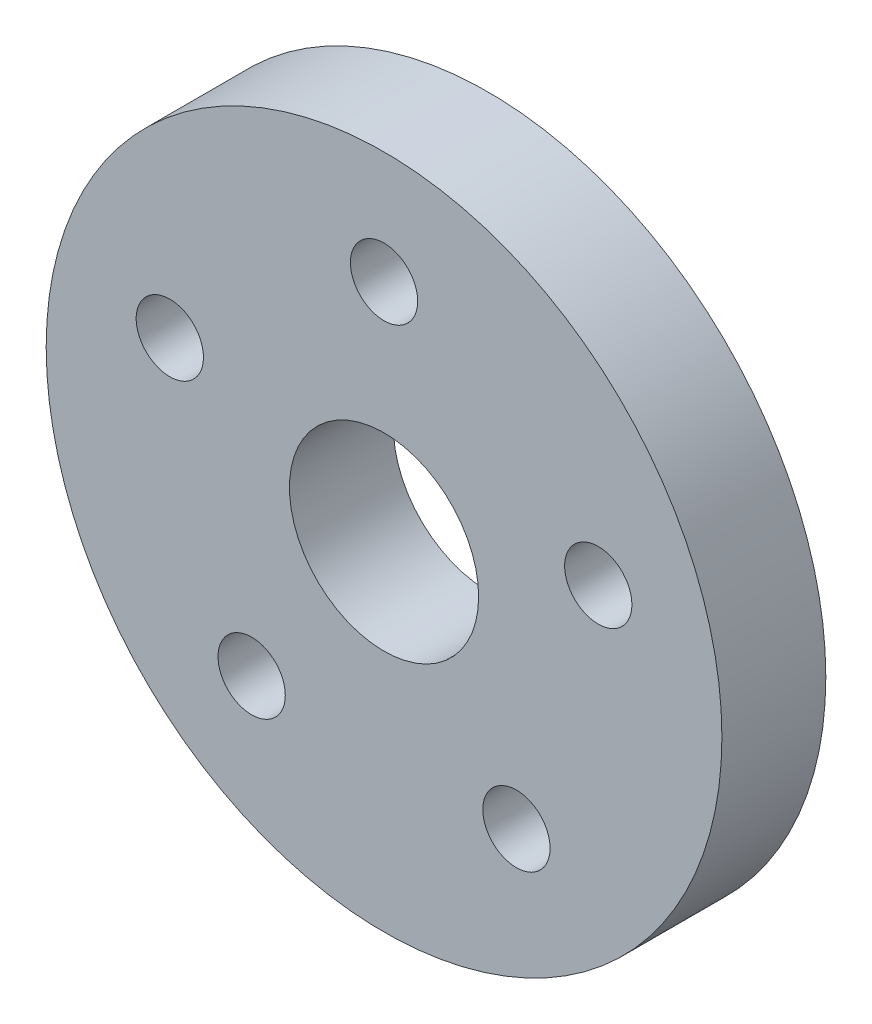
ISO-10303-21;
HEADER;
FILE_DESCRIPTION(('STEP AP214'),'2;1');
FILE_NAME('part.step','',(''),(''),'','','');
FILE_SCHEMA(('AUTOMOTIVE_DESIGN { 1 0 10303 214 1 1 1 1 }'));
ENDSEC;
DATA;
#1=APPLICATION_CONTEXT('core data for automotive mechanical design processes');
#2=APPLICATION_PROTOCOL_DEFINITION('international standard','automotive_design',2000,#1);
#3=PRODUCT_CONTEXT('',#1,'mechanical');
#4=PRODUCT('Part','Part','',(#3));
#5=PRODUCT_RELATED_PRODUCT_CATEGORY('part','',(#4));
#6=PRODUCT_DEFINITION_FORMATION('','',#4);
#7=PRODUCT_DEFINITION_CONTEXT('part definition',#1,'design');
#8=PRODUCT_DEFINITION('design','',#6,#7);
#9=PRODUCT_DEFINITION_SHAPE('','',#8);
#10=(LENGTH_UNIT() NAMED_UNIT(*) SI_UNIT(.MILLI.,.METRE.));
#11=(NAMED_UNIT(*) PLANE_ANGLE_UNIT() SI_UNIT($,.RADIAN.));
#12=(NAMED_UNIT(*) SI_UNIT($,.STERADIAN.) SOLID_ANGLE_UNIT());
#13=UNCERTAINTY_MEASURE_WITH_UNIT(LENGTH_MEASURE(1.E-05),#10,'distance_accuracy_value','');
#14=(GEOMETRIC_REPRESENTATION_CONTEXT(3) GLOBAL_UNCERTAINTY_ASSIGNED_CONTEXT((#13)) GLOBAL_UNIT_ASSIGNED_CONTEXT((#10,
#11,#12)) REPRESENTATION_CONTEXT('',''));
#15=CARTESIAN_POINT('',(0.,0.,0.));
#16=DIRECTION('',(0.,0.,1.));
#17=DIRECTION('',(1.,0.,0.));
#18=AXIS2_PLACEMENT_3D('',#15,#16,#17);
#19=CARTESIAN_POINT('',(0.,0.,4.3942));
#20=DIRECTION('',(0.,0.,1.));
#21=DIRECTION('',(1.,0.,0.));
#22=AXIS2_PLACEMENT_3D('',#19,#20,#21);
#23=PLANE('',#22);
#24=CARTESIAN_POINT('',(-5.59865452808532,-7.70588687142153,4.3942));
#25=DIRECTION('',(0.,0.,1.));
#26=DIRECTION('',(1.,0.,0.));
#27=AXIS2_PLACEMENT_3D('',#24,#25,#26);
#28=CIRCLE('',#27,1.42240000000059);
#29=CARTESIAN_POINT('',(-4.17625452808473,-7.70588687142153,4.3942));
#30=VERTEX_POINT('',#29);
#31=EDGE_CURVE('E65',#30,#30,#28,.T.);
#32=ORIENTED_EDGE('',*,*,#31,.F.);
#33=EDGE_LOOP('',(#32));
#34=FACE_BOUND('',#33,.T.);
#35=CARTESIAN_POINT('',(9.05881331771153,2.94338687142163,4.3942));
#36=DIRECTION('',(0.,0.,1.));
#37=DIRECTION('',(1.,0.,0.));
#38=AXIS2_PLACEMENT_3D('',#35,#36,#37);
#39=CIRCLE('',#38,1.42240000000013);
#40=CARTESIAN_POINT('',(10.4812133177117,2.94338687142163,4.3942));
#41=VERTEX_POINT('',#40);
#42=EDGE_CURVE('E53',#41,#41,#39,.T.);
#43=ORIENTED_EDGE('',*,*,#42,.F.);
#44=EDGE_LOOP('',(#43));
#45=FACE_BOUND('',#44,.T.);
#46=CARTESIAN_POINT('',(0.,0.,4.3942));
#47=DIRECTION('',(0.,0.,1.));
#48=DIRECTION('',(1.,0.,0.));
#49=AXIS2_PLACEMENT_3D('',#46,#47,#48);
#50=CIRCLE('',#49,4.);
#51=CARTESIAN_POINT('',(4.,0.,4.3942));
#52=VERTEX_POINT('',#51);
#53=EDGE_CURVE('E42',#52,#52,#50,.T.);
#54=ORIENTED_EDGE('',*,*,#53,.F.);
#55=EDGE_LOOP('',(#54));
#56=FACE_BOUND('',#55,.T.);
#57=CARTESIAN_POINT('',(0.,0.,4.3942));
#58=DIRECTION('',(0.,0.,1.));
#59=DIRECTION('',(1.,0.,0.));
#60=AXIS2_PLACEMENT_3D('',#57,#58,#59);
#61=CIRCLE('',#60,14.2875);
#62=CARTESIAN_POINT('',(14.2875,0.,4.3942));
#63=VERTEX_POINT('',#62);
#64=EDGE_CURVE('E10',#63,#63,#61,.T.);
#65=ORIENTED_EDGE('',*,*,#64,.T.);
#66=EDGE_LOOP('',(#65));
#67=FACE_BOUND('',#66,.T.);
#68=CARTESIAN_POINT('',(0.,9.525,4.3942));
#69=DIRECTION('',(0.,0.,1.));
#70=DIRECTION('',(1.,0.,0.));
#71=AXIS2_PLACEMENT_3D('',#68,#69,#70);
#72=CIRCLE('',#71,1.4224);
#73=CARTESIAN_POINT('',(1.4224,9.525,4.3942));
#74=VERTEX_POINT('',#73);
#75=EDGE_CURVE('E47',#74,#74,#72,.T.);
#76=ORIENTED_EDGE('',*,*,#75,.F.);
#77=EDGE_LOOP('',(#76));
#78=FACE_BOUND('',#77,.T.);
#79=CARTESIAN_POINT('',(5.5986545280863,-7.70588687142122,4.3942));
#80=DIRECTION('',(0.,0.,1.));
#81=DIRECTION('',(1.,0.,0.));
#82=AXIS2_PLACEMENT_3D('',#79,#80,#81);
#83=CIRCLE('',#82,1.42240000000047);
#84=CARTESIAN_POINT('',(7.02105452808677,-7.70588687142122,4.3942));
#85=VERTEX_POINT('',#84);
#86=EDGE_CURVE('E59',#85,#85,#83,.T.);
#87=ORIENTED_EDGE('',*,*,#86,.F.);
#88=EDGE_LOOP('',(#87));
#89=FACE_BOUND('',#88,.T.);
#90=CARTESIAN_POINT('',(-9.05881331771115,2.94338687142112,4.3942));
#91=DIRECTION('',(0.,0.,1.));
#92=DIRECTION('',(1.,0.,0.));
#93=AXIS2_PLACEMENT_3D('',#90,#91,#92);
#94=CIRCLE('',#93,1.42240000000036);
#95=CARTESIAN_POINT('',(-7.63641331771079,2.94338687142112,4.3942));
#96=VERTEX_POINT('',#95);
#97=EDGE_CURVE('E71',#96,#96,#94,.T.);
#98=ORIENTED_EDGE('',*,*,#97,.F.);
#99=EDGE_LOOP('',(#98));
#100=FACE_BOUND('',#99,.T.);
#101=ADVANCED_FACE('F31',(#34,#45,#56,#67,#78,#89,#100),#23,.T.);
#102=CARTESIAN_POINT('',(0.,0.,0.));
#103=DIRECTION('',(0.,0.,1.));
#104=DIRECTION('',(1.,0.,0.));
#105=AXIS2_PLACEMENT_3D('',#102,#103,#104);
#106=PLANE('',#105);
#107=CARTESIAN_POINT('',(-5.59865452808532,-7.70588687142153,0.));
#108=DIRECTION('',(0.,0.,1.));
#109=DIRECTION('',(1.,0.,0.));
#110=AXIS2_PLACEMENT_3D('',#107,#108,#109);
#111=CIRCLE('',#110,1.42240000000059);
#112=CARTESIAN_POINT('',(-4.17625452808473,-7.70588687142153,0.));
#113=VERTEX_POINT('',#112);
#114=EDGE_CURVE('E68',#113,#113,#111,.T.);
#115=ORIENTED_EDGE('',*,*,#114,.T.);
#116=EDGE_LOOP('',(#115));
#117=FACE_BOUND('',#116,.T.);
#118=CARTESIAN_POINT('',(9.05881331771153,2.94338687142163,0.));
#119=DIRECTION('',(0.,0.,1.));
#120=DIRECTION('',(1.,0.,0.));
#121=AXIS2_PLACEMENT_3D('',#118,#119,#120);
#122=CIRCLE('',#121,1.42240000000013);
#123=CARTESIAN_POINT('',(10.4812133177117,2.94338687142163,0.));
#124=VERTEX_POINT('',#123);
#125=EDGE_CURVE('E56',#124,#124,#122,.T.);
#126=ORIENTED_EDGE('',*,*,#125,.T.);
#127=EDGE_LOOP('',(#126));
#128=FACE_BOUND('',#127,.T.);
#129=CARTESIAN_POINT('',(0.,0.,0.));
#130=DIRECTION('',(0.,0.,1.));
#131=DIRECTION('',(1.,0.,0.));
#132=AXIS2_PLACEMENT_3D('',#129,#130,#131);
#133=CIRCLE('',#132,4.);
#134=CARTESIAN_POINT('',(4.,0.,0.));
#135=VERTEX_POINT('',#134);
#136=EDGE_CURVE('E44',#135,#135,#133,.T.);
#137=ORIENTED_EDGE('',*,*,#136,.T.);
#138=EDGE_LOOP('',(#137));
#139=FACE_BOUND('',#138,.T.);
#140=CARTESIAN_POINT('',(0.,0.,0.));
#141=DIRECTION('',(0.,0.,1.));
#142=DIRECTION('',(1.,0.,0.));
#143=AXIS2_PLACEMENT_3D('',#140,#141,#142);
#144=CIRCLE('',#143,14.2875);
#145=CARTESIAN_POINT('',(14.2875,0.,0.));
#146=VERTEX_POINT('',#145);
#147=EDGE_CURVE('E35',#146,#146,#144,.T.);
#148=ORIENTED_EDGE('',*,*,#147,.F.);
#149=EDGE_LOOP('',(#148));
#150=FACE_BOUND('',#149,.T.);
#151=CARTESIAN_POINT('',(0.,9.525,0.));
#152=DIRECTION('',(0.,0.,1.));
#153=DIRECTION('',(1.,0.,0.));
#154=AXIS2_PLACEMENT_3D('',#151,#152,#153);
#155=CIRCLE('',#154,1.4224);
#156=CARTESIAN_POINT('',(1.4224,9.525,0.));
#157=VERTEX_POINT('',#156);
#158=EDGE_CURVE('E50',#157,#157,#155,.T.);
#159=ORIENTED_EDGE('',*,*,#158,.T.);
#160=EDGE_LOOP('',(#159));
#161=FACE_BOUND('',#160,.T.);
#162=CARTESIAN_POINT('',(5.5986545280863,-7.70588687142122,0.));
#163=DIRECTION('',(0.,0.,1.));
#164=DIRECTION('',(1.,0.,0.));
#165=AXIS2_PLACEMENT_3D('',#162,#163,#164);
#166=CIRCLE('',#165,1.42240000000047);
#167=CARTESIAN_POINT('',(7.02105452808677,-7.70588687142122,0.));
#168=VERTEX_POINT('',#167);
#169=EDGE_CURVE('E62',#168,#168,#166,.T.);
#170=ORIENTED_EDGE('',*,*,#169,.T.);
#171=EDGE_LOOP('',(#170));
#172=FACE_BOUND('',#171,.T.);
#173=CARTESIAN_POINT('',(-9.05881331771115,2.94338687142112,0.));
#174=DIRECTION('',(0.,0.,1.));
#175=DIRECTION('',(1.,0.,0.));
#176=AXIS2_PLACEMENT_3D('',#173,#174,#175);
#177=CIRCLE('',#176,1.42240000000036);
#178=CARTESIAN_POINT('',(-7.63641331771079,2.94338687142112,0.));
#179=VERTEX_POINT('',#178);
#180=EDGE_CURVE('E74',#179,#179,#177,.T.);
#181=ORIENTED_EDGE('',*,*,#180,.T.);
#182=EDGE_LOOP('',(#181));
#183=FACE_BOUND('',#182,.T.);
#184=ADVANCED_FACE('F84',(#117,#128,#139,#150,#161,#172,#183),#106,.F.);
#185=CARTESIAN_POINT('',(0.,0.,4.3942));
#186=DIRECTION('',(0.,0.,-1.));
#187=DIRECTION('',(-1.,0.,0.));
#188=AXIS2_PLACEMENT_3D('',#185,#186,#187);
#189=CYLINDRICAL_SURFACE('',#188,14.2875);
#190=ORIENTED_EDGE('',*,*,#64,.F.);
#191=EDGE_LOOP('',(#190));
#192=FACE_BOUND('',#191,.T.);
#193=ORIENTED_EDGE('',*,*,#147,.T.);
#194=EDGE_LOOP('',(#193));
#195=FACE_BOUND('',#194,.T.);
#196=ADVANCED_FACE('F33',(#192,#195),#189,.T.);
#197=CARTESIAN_POINT('',(0.,0.,4.3942));
#198=DIRECTION('',(0.,0.,-1.));
#199=DIRECTION('',(-1.,0.,0.));
#200=AXIS2_PLACEMENT_3D('',#197,#198,#199);
#201=CYLINDRICAL_SURFACE('',#200,4.);
#202=ORIENTED_EDGE('',*,*,#53,.T.);
#203=EDGE_LOOP('',(#202));
#204=FACE_BOUND('',#203,.T.);
#205=ORIENTED_EDGE('',*,*,#136,.F.);
#206=EDGE_LOOP('',(#205));
#207=FACE_BOUND('',#206,.T.);
#208=ADVANCED_FACE('F94',(#204,#207),#201,.F.);
#209=CARTESIAN_POINT('',(0.,9.525,4.3942));
#210=DIRECTION('',(0.,0.,-1.));
#211=DIRECTION('',(-1.,0.,0.));
#212=AXIS2_PLACEMENT_3D('',#209,#210,#211);
#213=CYLINDRICAL_SURFACE('',#212,1.4224);
#214=ORIENTED_EDGE('',*,*,#75,.T.);
#215=EDGE_LOOP('',(#214));
#216=FACE_BOUND('',#215,.T.);
#217=ORIENTED_EDGE('',*,*,#158,.F.);
#218=EDGE_LOOP('',(#217));
#219=FACE_BOUND('',#218,.T.);
#220=ADVANCED_FACE('F97',(#216,#219),#213,.F.);
#221=CARTESIAN_POINT('',(9.05881331771153,2.94338687142163,4.3942));
#222=DIRECTION('',(0.,0.,-1.));
#223=DIRECTION('',(-1.,0.,0.));
#224=AXIS2_PLACEMENT_3D('',#221,#222,#223);
#225=CYLINDRICAL_SURFACE('',#224,1.42240000000013);
#226=ORIENTED_EDGE('',*,*,#42,.T.);
#227=EDGE_LOOP('',(#226));
#228=FACE_BOUND('',#227,.T.);
#229=ORIENTED_EDGE('',*,*,#125,.F.);
#230=EDGE_LOOP('',(#229));
#231=FACE_BOUND('',#230,.T.);
#232=ADVANCED_FACE('F101',(#228,#231),#225,.F.);
#233=CARTESIAN_POINT('',(5.5986545280863,-7.70588687142122,4.3942));
#234=DIRECTION('',(0.,0.,-1.));
#235=DIRECTION('',(-1.,0.,0.));
#236=AXIS2_PLACEMENT_3D('',#233,#234,#235);
#237=CYLINDRICAL_SURFACE('',#236,1.42240000000047);
#238=ORIENTED_EDGE('',*,*,#86,.T.);
#239=EDGE_LOOP('',(#238));
#240=FACE_BOUND('',#239,.T.);
#241=ORIENTED_EDGE('',*,*,#169,.F.);
#242=EDGE_LOOP('',(#241));
#243=FACE_BOUND('',#242,.T.);
#244=ADVANCED_FACE('F105',(#240,#243),#237,.F.);
#245=CARTESIAN_POINT('',(-5.59865452808532,-7.70588687142153,4.3942));
#246=DIRECTION('',(0.,0.,-1.));
#247=DIRECTION('',(-1.,0.,0.));
#248=AXIS2_PLACEMENT_3D('',#245,#246,#247);
#249=CYLINDRICAL_SURFACE('',#248,1.42240000000059);
#250=ORIENTED_EDGE('',*,*,#31,.T.);
#251=EDGE_LOOP('',(#250));
#252=FACE_BOUND('',#251,.T.);
#253=ORIENTED_EDGE('',*,*,#114,.F.);
#254=EDGE_LOOP('',(#253));
#255=FACE_BOUND('',#254,.T.);
#256=ADVANCED_FACE('F109',(#252,#255),#249,.F.);
#257=CARTESIAN_POINT('',(-9.05881331771115,2.94338687142112,4.3942));
#258=DIRECTION('',(0.,0.,-1.));
#259=DIRECTION('',(-1.,0.,0.));
#260=AXIS2_PLACEMENT_3D('',#257,#258,#259);
#261=CYLINDRICAL_SURFACE('',#260,1.42240000000036);
#262=ORIENTED_EDGE('',*,*,#97,.T.);
#263=EDGE_LOOP('',(#262));
#264=FACE_BOUND('',#263,.T.);
#265=ORIENTED_EDGE('',*,*,#180,.F.);
#266=EDGE_LOOP('',(#265));
#267=FACE_BOUND('',#266,.T.);
#268=ADVANCED_FACE('F80',(#264,#267),#261,.F.);
#269=CLOSED_SHELL('',(#101,#184,#196,#208,#220,#232,#244,#256,#268));
#270=MANIFOLD_SOLID_BREP('B2',#269);
#271=ADVANCED_BREP_SHAPE_REPRESENTATION('',(#18,#270),#14);
#272=SHAPE_DEFINITION_REPRESENTATION(#9,#271);
ENDSEC;
END-ISO-10303-21;
